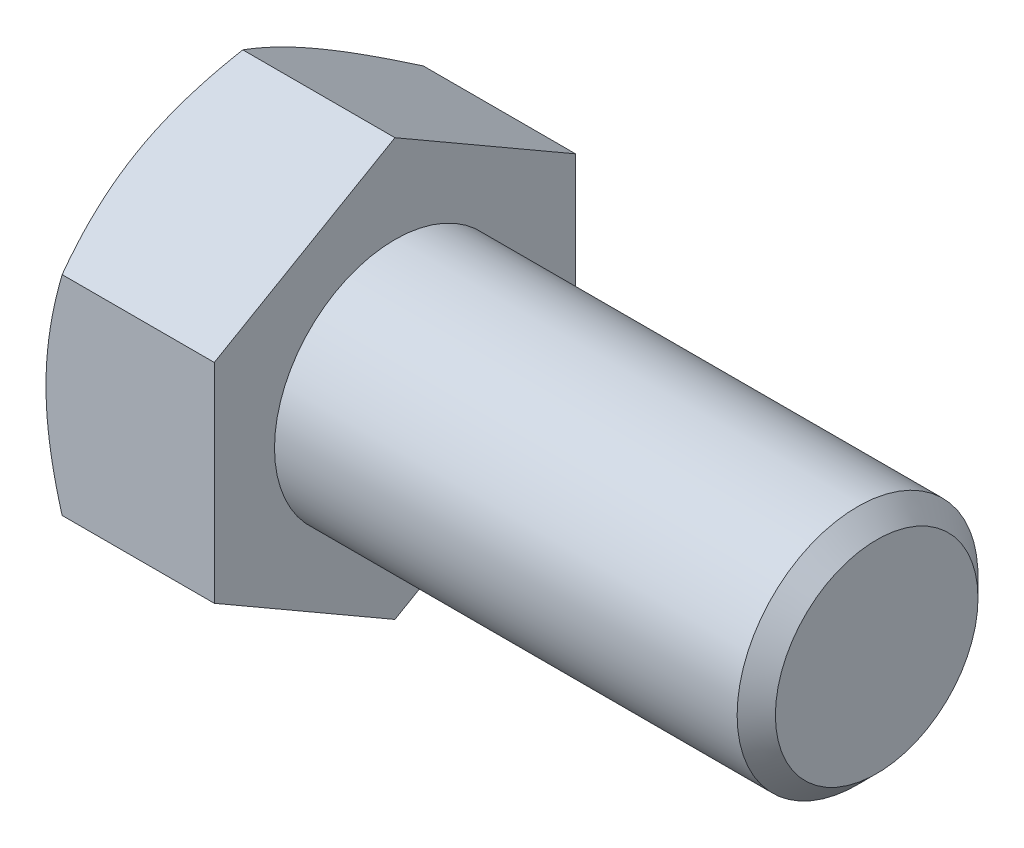
ISO-10303-21;
HEADER;
FILE_DESCRIPTION(('STEP AP214'),'2;1');
FILE_NAME('part.step','',(''),(''),'','','');
FILE_SCHEMA(('AUTOMOTIVE_DESIGN { 1 0 10303 214 1 1 1 1 }'));
ENDSEC;
DATA;
#1=APPLICATION_CONTEXT('core data for automotive mechanical design processes');
#2=APPLICATION_PROTOCOL_DEFINITION('international standard','automotive_design',2000,#1);
#3=PRODUCT_CONTEXT('',#1,'mechanical');
#4=PRODUCT('Part','Part','',(#3));
#5=PRODUCT_RELATED_PRODUCT_CATEGORY('part','',(#4));
#6=PRODUCT_DEFINITION_FORMATION('','',#4);
#7=PRODUCT_DEFINITION_CONTEXT('part definition',#1,'design');
#8=PRODUCT_DEFINITION('design','',#6,#7);
#9=PRODUCT_DEFINITION_SHAPE('','',#8);
#10=(LENGTH_UNIT() NAMED_UNIT(*) SI_UNIT(.MILLI.,.METRE.));
#11=(NAMED_UNIT(*) PLANE_ANGLE_UNIT() SI_UNIT($,.RADIAN.));
#12=(NAMED_UNIT(*) SI_UNIT($,.STERADIAN.) SOLID_ANGLE_UNIT());
#13=UNCERTAINTY_MEASURE_WITH_UNIT(LENGTH_MEASURE(1.E-05),#10,'distance_accuracy_value','');
#14=(GEOMETRIC_REPRESENTATION_CONTEXT(3) GLOBAL_UNCERTAINTY_ASSIGNED_CONTEXT((#13)) GLOBAL_UNIT_ASSIGNED_CONTEXT((#10,
#11,#12)) REPRESENTATION_CONTEXT('',''));
#15=CARTESIAN_POINT('',(0.,0.,0.));
#16=DIRECTION('',(0.,0.,1.));
#17=DIRECTION('',(1.,0.,0.));
#18=AXIS2_PLACEMENT_3D('',#15,#16,#17);
#19=CARTESIAN_POINT('',(13.3096,8.24889197104677,-14.2875));
#20=DIRECTION('',(0.,-0.866025403784438,0.5));
#21=DIRECTION('',(0.,-0.5,-0.866025403784438));
#22=AXIS2_PLACEMENT_3D('',#19,#20,#21);
#23=PLANE('',#22);
#24=CARTESIAN_POINT('',(1.27617469631979,16.4978994121474,0.000199999999999582));
#25=CARTESIAN_POINT('',(1.17150354049374,16.316591962665,-0.313833714294314));
#26=CARTESIAN_POINT('',(1.07158215537579,16.1345773166767,-0.629092328867607));
#27=CARTESIAN_POINT('',(0.882559201585307,15.7690884807822,-1.26213756223605));
#28=CARTESIAN_POINT('',(0.793461191524302,15.5856138318553,-1.5799249760784));
#29=CARTESIAN_POINT('',(0.627282646740068,15.2168504028066,-2.21864197116398));
#30=CARTESIAN_POINT('',(0.550230545696853,15.0315583957425,-2.53957714163546));
#31=CARTESIAN_POINT('',(0.409798352887989,14.6596868248225,-3.18367759635941));
#32=CARTESIAN_POINT('',(0.346417481149996,14.4731073350473,-3.50684275230036));
#33=CARTESIAN_POINT('',(0.236023554267069,14.1034416805247,-4.14712244774659));
#34=CARTESIAN_POINT('',(0.188645115273865,13.9203829601652,-4.46418945217786));
#35=CARTESIAN_POINT('',(0.109201912674412,13.5534267067704,-5.09977632721271));
#36=CARTESIAN_POINT('',(0.0771374438271073,13.3695291576584,-5.41829622566207));
#37=CARTESIAN_POINT('',(0.0291317909883738,13.0014251352584,-6.05587109492942));
#38=CARTESIAN_POINT('',(0.0131714475146444,12.8172192908535,-6.37492497648983));
#39=CARTESIAN_POINT('',(-0.00228271550063084,12.448637559964,-7.01332726113216));
#40=CARTESIAN_POINT('',(-0.00177704383827308,12.2642616789095,-7.33267565480881));
#41=CARTESIAN_POINT('',(0.0145506803037078,11.9195719861559,-7.92969571550333));
#42=CARTESIAN_POINT('',(0.0283811431962136,11.759233611051,-8.20740992758799));
#43=CARTESIAN_POINT('',(0.0682339694513755,11.4389256760858,-8.76219954501513));
#44=CARTESIAN_POINT('',(0.0942571951847597,11.2789561431174,-9.03927490377954));
#45=CARTESIAN_POINT('',(0.158041814881286,10.9594727825021,-9.59263631653807));
#46=CARTESIAN_POINT('',(0.195812903582829,10.7999594414437,-9.86892152773624));
#47=CARTESIAN_POINT('',(0.282430562472694,10.4816805882453,-10.4201966724507));
#48=CARTESIAN_POINT('',(0.331277885597339,10.3229151276936,-10.6951865166133));
#49=CARTESIAN_POINT('',(0.495669002146555,9.84097374681805,-11.5299334745597));
#50=CARTESIAN_POINT('',(0.627604309461495,9.51919345055701,-12.0872732965584));
#51=CARTESIAN_POINT('',(0.927043495545048,8.88043099732144,-13.1936423195297));
#52=CARTESIAN_POINT('',(1.09447704990011,8.56344066203608,-13.7426856857522));
#53=CARTESIAN_POINT('',(1.27617469631978,8.24877650099293,-14.2877));
#54=B_SPLINE_CURVE_WITH_KNOTS('',3,(#24,#25,#26,#27,#28,#29,#30,#31,#32,#33,#34,#35,#36,#37,#38,
#39,#40,#41,#42,#43,#44,#45,#46,#47,#48,#49,#50,#51,#52,#53),.UNSPECIFIED.,.F.,.F.,(4,2,2,2,2,2,
2,2,2,2,2,2,2,2,4),(0.,1.1322886698782,2.26494862244556,3.40024304981971,4.53547268912058,
5.64268215336774,6.74991292800918,7.85582484363027,8.96170258685889,9.92439507576008,
10.8871556643353,11.8507128733959,12.8143356024524,14.7839571212635,16.7497125507192),.UNSPECIFIED.);
#55=CARTESIAN_POINT('',(1.27610802895322,16.4977839420936,0.));
#56=VERTEX_POINT('',#55);
#57=CARTESIAN_POINT('',(0.,12.3733379565702,-7.14375));
#58=VERTEX_POINT('',#57);
#59=EDGE_CURVE('E33',#56,#58,#54,.T.);
#60=ORIENTED_EDGE('',*,*,#59,.F.);
#61=DIRECTION('',(-1.,0.,0.));
#62=VECTOR('',#61,1.);
#63=CARTESIAN_POINT('',(13.3096,16.4977839420936,0.));
#64=LINE('',#63,#62);
#65=CARTESIAN_POINT('',(13.3096,16.4977839420936,0.));
#66=VERTEX_POINT('',#65);
#67=EDGE_CURVE('E129',#66,#56,#64,.T.);
#68=ORIENTED_EDGE('',*,*,#67,.F.);
#69=DIRECTION('',(0.,0.5,0.866025403784438));
#70=VECTOR('',#69,1.);
#71=CARTESIAN_POINT('',(13.3096,8.24889197104677,-14.2875));
#72=LINE('',#71,#70);
#73=CARTESIAN_POINT('',(13.3096,8.24889197104677,-14.2875));
#74=VERTEX_POINT('',#73);
#75=EDGE_CURVE('E214',#74,#66,#72,.T.);
#76=ORIENTED_EDGE('',*,*,#75,.F.);
#77=DIRECTION('',(-1.,0.,0.));
#78=VECTOR('',#77,1.);
#79=CARTESIAN_POINT('',(13.3096,8.24889197104677,-14.2875));
#80=LINE('',#79,#78);
#81=CARTESIAN_POINT('',(1.27610802895321,8.24889197104677,-14.2875));
#82=VERTEX_POINT('',#81);
#83=EDGE_CURVE('E117',#74,#82,#80,.T.);
#84=ORIENTED_EDGE('',*,*,#83,.T.);
#85=EDGE_CURVE('E111',#58,#82,#54,.T.);
#86=ORIENTED_EDGE('',*,*,#85,.F.);
#87=EDGE_LOOP('',(#60,#68,#76,#84,#86));
#88=FACE_BOUND('',#87,.T.);
#89=ADVANCED_FACE('F17',(#88),#23,.F.);
#90=CARTESIAN_POINT('',(13.3096,16.4977839420936,0.));
#91=DIRECTION('',(0.,-0.866025403784438,-0.5));
#92=DIRECTION('',(0.,0.5,-0.866025403784438));
#93=AXIS2_PLACEMENT_3D('',#90,#91,#92);
#94=PLANE('',#93);
#95=CARTESIAN_POINT('',(1.27617469631978,8.24877650099293,14.2877));
#96=CARTESIAN_POINT('',(1.17150354049373,8.43008395047537,13.9736662857057));
#97=CARTESIAN_POINT('',(1.07158215537578,8.61209859646361,13.6584076711324));
#98=CARTESIAN_POINT('',(0.882559201585304,8.97758743235809,13.0253624377639));
#99=CARTESIAN_POINT('',(0.793461191524299,9.16106208128505,12.7075750239216));
#100=CARTESIAN_POINT('',(0.627282646740065,9.5298255103337,12.068858028836));
#101=CARTESIAN_POINT('',(0.55023054569685,9.71511751739782,11.7479228583645));
#102=CARTESIAN_POINT('',(0.409798352887985,10.0869890883179,11.1038224036406));
#103=CARTESIAN_POINT('',(0.346417481149992,10.2735685780931,10.7806572476996));
#104=CARTESIAN_POINT('',(0.236023554267066,10.6432342326156,10.1403775522534));
#105=CARTESIAN_POINT('',(0.188645115273862,10.8262929529751,9.82331054782214));
#106=CARTESIAN_POINT('',(0.10920191267441,11.1932492063699,9.18772367278729));
#107=CARTESIAN_POINT('',(0.0771374438271041,11.3771467554819,8.86920377433793));
#108=CARTESIAN_POINT('',(0.02913179098837,11.7452507778819,8.23162890507058));
#109=CARTESIAN_POINT('',(0.0131714475146414,11.9294566222868,7.91257502351017));
#110=CARTESIAN_POINT('',(-0.00228271550063179,12.2980383531764,7.27417273886784));
#111=CARTESIAN_POINT('',(-0.00177704383827272,12.4824142342309,6.9548243451912));
#112=CARTESIAN_POINT('',(0.0145506803037076,12.8271039269845,6.35780428449668));
#113=CARTESIAN_POINT('',(0.0283811431962119,12.9874423020893,6.08009007241201));
#114=CARTESIAN_POINT('',(0.0682339694513732,13.3077502370545,5.52530045498486));
#115=CARTESIAN_POINT('',(0.0942571951847582,13.4677197700229,5.24822509622045));
#116=CARTESIAN_POINT('',(0.158041814881286,13.7872031306382,4.69486368346192));
#117=CARTESIAN_POINT('',(0.195812903582829,13.9467164716966,4.41857847226376));
#118=CARTESIAN_POINT('',(0.282430562472695,14.264995324895,3.86730332754926));
#119=CARTESIAN_POINT('',(0.331277885597339,14.4237607854467,3.59231348338674));
#120=CARTESIAN_POINT('',(0.495669002146554,14.9057021663223,2.75756652544034));
#121=CARTESIAN_POINT('',(0.627604309461494,15.2274824625833,2.20022670344164));
#122=CARTESIAN_POINT('',(0.927043495545049,15.8662449158189,1.09385768047029));
#123=CARTESIAN_POINT('',(1.09447704990012,16.1832352511043,0.544814314247755));
#124=CARTESIAN_POINT('',(1.27617469631979,16.4978994121474,-0.000200000000001206));
#125=B_SPLINE_CURVE_WITH_KNOTS('',3,(#95,#96,#97,#98,#99,#100,#101,#102,#103,#104,#105,#106,
#107,#108,#109,#110,#111,#112,#113,#114,#115,#116,#117,#118,#119,#120,#121,#122,#123,#124),
.UNSPECIFIED.,.F.,.F.,(4,2,2,2,2,2,2,2,2,2,2,2,2,2,4),(0.,1.1322886698782,2.26494862244556,
3.4002430498197,4.53547268912058,5.64268215336774,6.74991292800917,7.85582484363026,
8.96170258685889,9.92439507576008,10.8871556643353,11.8507128733959,12.8143356024524,
14.7839571212635,16.7497125507192),.UNSPECIFIED.);
#126=CARTESIAN_POINT('',(1.27610802895321,8.24889197104677,14.2875));
#127=VERTEX_POINT('',#126);
#128=CARTESIAN_POINT('',(0.,12.3733379565702,7.14375));
#129=VERTEX_POINT('',#128);
#130=EDGE_CURVE('E40',#127,#129,#125,.T.);
#131=ORIENTED_EDGE('',*,*,#130,.F.);
#132=DIRECTION('',(-1.,0.,0.));
#133=VECTOR('',#132,1.);
#134=CARTESIAN_POINT('',(13.3096,8.24889197104677,14.2875));
#135=LINE('',#134,#133);
#136=CARTESIAN_POINT('',(13.3096,8.24889197104677,14.2875));
#137=VERTEX_POINT('',#136);
#138=EDGE_CURVE('E127',#137,#127,#135,.T.);
#139=ORIENTED_EDGE('',*,*,#138,.F.);
#140=DIRECTION('',(0.,-0.5,0.866025403784438));
#141=VECTOR('',#140,1.);
#142=CARTESIAN_POINT('',(13.3096,16.4977839420936,0.));
#143=LINE('',#142,#141);
#144=EDGE_CURVE('E212',#66,#137,#143,.T.);
#145=ORIENTED_EDGE('',*,*,#144,.F.);
#146=ORIENTED_EDGE('',*,*,#67,.T.);
#147=EDGE_CURVE('E144',#129,#56,#125,.T.);
#148=ORIENTED_EDGE('',*,*,#147,.F.);
#149=EDGE_LOOP('',(#131,#139,#145,#146,#148));
#150=FACE_BOUND('',#149,.T.);
#151=ADVANCED_FACE('F150',(#150),#94,.F.);
#152=CARTESIAN_POINT('',(13.3096,8.24889197104677,14.2875));
#153=DIRECTION('',(0.,0.,-1.));
#154=DIRECTION('',(0.,1.,0.));
#155=AXIS2_PLACEMENT_3D('',#152,#153,#154);
#156=PLANE('',#155);
#157=CARTESIAN_POINT('',(7.08559653091287,-22.3898851403977,14.2875));
#158=CARTESIAN_POINT('',(6.93326774728018,-22.0768961485065,14.2875));
#159=CARTESIAN_POINT('',(6.78168115524728,-21.7635461076253,14.2875));
#160=CARTESIAN_POINT('',(6.48015999479454,-21.1360486675519,14.2875));
#161=CARTESIAN_POINT('',(6.3302254422901,-20.8219012607137,14.2875));
#162=CARTESIAN_POINT('',(5.88311326936994,-19.8780695997121,14.2875));
#163=CARTESIAN_POINT('',(5.58867059111872,-19.247084957934,14.2875));
#164=CARTESIAN_POINT('',(5.00727922083418,-17.9776461473273,14.2875));
#165=CARTESIAN_POINT('',(4.72037808476414,-17.3391701473184,14.2875));
#166=CARTESIAN_POINT('',(4.15800525940538,-16.0572214756457,14.2875));
#167=CARTESIAN_POINT('',(3.88253304540861,-15.4137490349849,14.2875));
#168=CARTESIAN_POINT('',(3.3370396675848,-14.0991063623123,14.2875));
#169=CARTESIAN_POINT('',(3.06751087102779,-13.427730783812,14.2875));
#170=CARTESIAN_POINT('',(2.54829414701892,-12.0772064856565,14.2875));
#171=CARTESIAN_POINT('',(2.29860841369515,-11.3980569158718,14.2875));
#172=CARTESIAN_POINT('',(1.82546713347176,-10.0321237241472,14.2875));
#173=CARTESIAN_POINT('',(1.60196042520998,-9.34535796384217,14.2875));
#174=CARTESIAN_POINT('',(1.18818152853814,-7.96191308991347,14.2875));
#175=CARTESIAN_POINT('',(0.997899114310368,-7.26523709812134,14.2875));
#176=CARTESIAN_POINT('',(0.744688974538726,-6.21459800125072,14.2875));
#177=CARTESIAN_POINT('',(0.665833592890657,-5.86445181168125,14.2875));
#178=CARTESIAN_POINT('',(0.519775761529073,-5.16172478937007,14.2875));
#179=CARTESIAN_POINT('',(0.452573084094944,-4.809144004346,14.2875));
#180=CARTESIAN_POINT('',(0.330991997803059,-4.1017733146598,14.2875));
#181=CARTESIAN_POINT('',(0.276613366867474,-3.74698344836222,14.2875));
#182=CARTESIAN_POINT('',(0.181756259237052,-3.03555342863086,14.2875));
#183=CARTESIAN_POINT('',(0.141277163865972,-2.67891335826818,14.2875));
#184=CARTESIAN_POINT('',(0.075543650045434,-1.96903610663562,14.2875));
#185=CARTESIAN_POINT('',(0.0500928077740681,-1.61581722652355,14.2875));
#186=CARTESIAN_POINT('',(0.0141622343996009,-0.908619532356783,14.2875));
#187=CARTESIAN_POINT('',(0.00368224833251761,-0.554640731346896,14.2875));
#188=CARTESIAN_POINT('',(-0.00205625515740654,0.153442979231244,14.2875));
#189=CARTESIAN_POINT('',(0.00268522427340234,0.507547888773415,14.2875));
#190=CARTESIAN_POINT('',(0.027271291764438,1.21523734452437,14.2875));
#191=CARTESIAN_POINT('',(0.0471165519034985,1.56882186687577,14.2875));
#192=CARTESIAN_POINT('',(0.111996031071708,2.4116583797756,14.2875));
#193=CARTESIAN_POINT('',(0.163810406450368,2.90039811194561,14.2875));
#194=CARTESIAN_POINT('',(0.293528569466128,3.87440480488909,14.2875));
#195=CARTESIAN_POINT('',(0.371435712647262,4.35967131080164,14.2875));
#196=CARTESIAN_POINT('',(0.550568352001118,5.32621625313482,14.2875));
#197=CARTESIAN_POINT('',(0.651811306760672,5.80749142276727,14.2875));
#198=CARTESIAN_POINT('',(0.874513374276012,6.76529068673456,14.2875));
#199=CARTESIAN_POINT('',(0.995972236678832,7.24181483982835,14.2875));
#200=CARTESIAN_POINT('',(1.25905167417799,8.20075205778827,14.2875));
#201=CARTESIAN_POINT('',(1.40106388456011,8.68305692684689,14.2875));
#202=CARTESIAN_POINT('',(1.70023403432786,9.64291929226151,14.2875));
#203=CARTESIAN_POINT('',(1.85739207777889,10.1204767559737,14.2875));
#204=CARTESIAN_POINT('',(2.18431745757463,11.0710723127659,14.2875));
#205=CARTESIAN_POINT('',(2.35408093456882,11.544111739462,14.2875));
#206=CARTESIAN_POINT('',(2.70417375232529,12.4862394675865,14.2875));
#207=CARTESIAN_POINT('',(2.88450294276728,12.9553278251189,14.2875));
#208=CARTESIAN_POINT('',(3.33642274249973,14.0985450123052,14.2875));
#209=CARTESIAN_POINT('',(3.61283070485534,14.770767095611,14.2875));
#210=CARTESIAN_POINT('',(4.17998789378479,16.1091534086177,14.2875));
#211=CARTESIAN_POINT('',(4.470738180305,16.7753171862673,14.2875));
#212=CARTESIAN_POINT('',(5.06358550000991,18.1027741716843,14.2875));
#213=CARTESIAN_POINT('',(5.36568552575697,18.7640660391256,14.2875));
#214=CARTESIAN_POINT('',(5.97884038094197,20.0824528287766,14.2875));
#215=CARTESIAN_POINT('',(6.28989497805701,20.7395478593321,14.2875));
#216=CARTESIAN_POINT('',(6.91960732570601,22.0510812939211,14.2875));
#217=CARTESIAN_POINT('',(7.23827402908063,22.7055153913756,14.2875));
#218=CARTESIAN_POINT('',(7.88149356008952,24.0114843998786,14.2875));
#219=CARTESIAN_POINT('',(8.2060464185312,24.6630192957309,14.2875));
#220=CARTESIAN_POINT('',(8.85994319829522,25.9635553617576,14.2875));
#221=CARTESIAN_POINT('',(9.1892863940345,26.6125568971502,14.2875));
#222=CARTESIAN_POINT('',(9.85199752739623,27.9084978324255,14.2875));
#223=CARTESIAN_POINT('',(10.1853654561409,28.555437236853,14.2875));
#224=CARTESIAN_POINT('',(11.1306522678145,30.3782153849138,14.2875));
#225=CARTESIAN_POINT('',(11.7464658067758,31.5520342270543,14.2875));
#226=CARTESIAN_POINT('',(12.9863637492688,33.8953480220263,14.2875));
#227=CARTESIAN_POINT('',(13.6104484992591,35.0648427910931,14.2875));
#228=CARTESIAN_POINT('',(14.8631697843525,37.3972192211191,14.2875));
#229=CARTESIAN_POINT('',(15.4917889329957,38.5601102267932,14.2875));
#230=CARTESIAN_POINT('',(16.4383496296699,40.3024250307733,14.2875));
#231=CARTESIAN_POINT('',(16.7544655515047,40.8828421143772,14.2875));
#232=CARTESIAN_POINT('',(17.3877853934411,42.0430813057571,14.2875));
#233=CARTESIAN_POINT('',(17.7049893118937,42.6229034144332,14.2875));
#234=CARTESIAN_POINT('',(18.0226732632783,43.2024624684083,14.2875));
#235=B_SPLINE_CURVE_WITH_KNOTS('',3,(#157,#158,#159,#160,#161,#162,#163,#164,#165,#166,#167,
#168,#169,#170,#171,#172,#173,#174,#175,#176,#177,#178,#179,#180,#181,#182,#183,#184,#185,#186,
#187,#188,#189,#190,#191,#192,#193,#194,#195,#196,#197,#198,#199,#200,#201,#202,#203,#204,#205,
#206,#207,#208,#209,#210,#211,#212,#213,#214,#215,#216,#217,#218,#219,#220,#221,#222,#223,#224,
#225,#226,#227,#228,#229,#230,#231,#232,#233,#234),.UNSPECIFIED.,.F.,.F.,(4,2,2,2,2,2,2,2,2,2,2,
2,2,2,2,2,2,2,2,2,2,2,2,2,2,2,2,2,2,2,2,2,2,2,2,2,2,2,4),(0.,1.04426611026885,2.08854227199574,
4.17739185153995,6.27722701936104,8.37696567568249,10.5470989949833,12.7174719418313,
14.8835299683505,17.048920142941,18.1255049291752,19.2020686740974,20.2786137744759,
21.3551109510055,22.4172073060168,23.4792855725806,24.5413636196078,25.6034889291002,
27.0771146749695,28.5509300027185,30.0258515587195,31.5007548507115,33.0087918261306,
34.5168391638508,36.024426678107,37.5319927488532,39.7122554194619,41.8926794609792,
44.0736825017389,46.2546290081198,48.4382809122898,50.6219442487211,52.8052802048644,
54.9886113458609,58.9652044042268,62.9419645611425,66.9077143187839,68.8904689713398,
70.8732206202619),.UNSPECIFIED.);
#236=CARTESIAN_POINT('',(1.27610802895322,-8.2488919710468,14.2875));
#237=VERTEX_POINT('',#236);
#238=CARTESIAN_POINT('',(0.,0.,14.2875));
#239=VERTEX_POINT('',#238);
#240=EDGE_CURVE('E224',#237,#239,#235,.T.);
#241=ORIENTED_EDGE('',*,*,#240,.F.);
#242=DIRECTION('',(-1.,0.,0.));
#243=VECTOR('',#242,1.);
#244=CARTESIAN_POINT('',(13.3096,-8.2488919710468,14.2875));
#245=LINE('',#244,#243);
#246=CARTESIAN_POINT('',(13.3096,-8.2488919710468,14.2875));
#247=VERTEX_POINT('',#246);
#248=EDGE_CURVE('E119',#247,#237,#245,.T.);
#249=ORIENTED_EDGE('',*,*,#248,.F.);
#250=DIRECTION('',(0.,-1.,0.));
#251=VECTOR('',#250,1.);
#252=CARTESIAN_POINT('',(13.3096,8.24889197104677,14.2875));
#253=LINE('',#252,#251);
#254=EDGE_CURVE('E208',#137,#247,#253,.T.);
#255=ORIENTED_EDGE('',*,*,#254,.F.);
#256=ORIENTED_EDGE('',*,*,#138,.T.);
#257=EDGE_CURVE('E166',#239,#127,#235,.T.);
#258=ORIENTED_EDGE('',*,*,#257,.F.);
#259=EDGE_LOOP('',(#241,#249,#255,#256,#258));
#260=FACE_BOUND('',#259,.T.);
#261=ADVANCED_FACE('F230',(#260),#156,.F.);
#262=CARTESIAN_POINT('',(13.3096,-16.4977839420936,0.));
#263=DIRECTION('',(0.,0.866025403784438,-0.5));
#264=DIRECTION('',(0.,0.5,0.866025403784438));
#265=AXIS2_PLACEMENT_3D('',#262,#263,#264);
#266=PLANE('',#265);
#267=CARTESIAN_POINT('',(1.27617469631981,-16.4978994121474,-0.000200000000000083));
#268=CARTESIAN_POINT('',(1.17150354049376,-16.316591962665,0.313833714294316));
#269=CARTESIAN_POINT('',(1.07158215537581,-16.1345773166768,0.629092328867609));
#270=CARTESIAN_POINT('',(0.882559201585333,-15.7690884807823,1.26213756223605));
#271=CARTESIAN_POINT('',(0.793461191524326,-15.5856138318553,1.5799249760784));
#272=CARTESIAN_POINT('',(0.627282646740092,-15.2168504028067,2.21864197116398));
#273=CARTESIAN_POINT('',(0.550230545696877,-15.0315583957425,2.53957714163546));
#274=CARTESIAN_POINT('',(0.409798352888013,-14.6596868248225,3.18367759635942));
#275=CARTESIAN_POINT('',(0.346417481150019,-14.4731073350473,3.50684275230037));
#276=CARTESIAN_POINT('',(0.236023554267092,-14.1034416805248,4.1471224477466));
#277=CARTESIAN_POINT('',(0.188645115273888,-13.9203829601652,4.46418945217787));
#278=CARTESIAN_POINT('',(0.109201912674435,-13.5534267067705,5.09977632721272));
#279=CARTESIAN_POINT('',(0.0771374438271293,-13.3695291576585,5.41829622566208));
#280=CARTESIAN_POINT('',(0.0291317909883963,-13.0014251352584,6.05587109492943));
#281=CARTESIAN_POINT('',(0.0131714475146685,-12.8172192908535,6.37492497648984));
#282=CARTESIAN_POINT('',(-0.00228271550061085,-12.448637559964,7.01332726113217));
#283=CARTESIAN_POINT('',(-0.00177704383825873,-12.2642616789095,7.33267565480882));
#284=CARTESIAN_POINT('',(0.014550680303723,-11.9195719861559,7.92969571550334));
#285=CARTESIAN_POINT('',(0.0283811431962337,-11.759233611051,8.20740992758801));
#286=CARTESIAN_POINT('',(0.0682339694513993,-11.4389256760859,8.76219954501515));
#287=CARTESIAN_POINT('',(0.0942571951847822,-11.2789561431174,9.03927490377956));
#288=CARTESIAN_POINT('',(0.158041814881308,-10.9594727825022,9.59263631653809));
#289=CARTESIAN_POINT('',(0.19581290358285,-10.7999594414438,9.86892152773625));
#290=CARTESIAN_POINT('',(0.282430562472715,-10.4816805882453,10.4201966724507));
#291=CARTESIAN_POINT('',(0.33127788559736,-10.3229151276937,10.6951865166133));
#292=CARTESIAN_POINT('',(0.495669002146575,-9.8409737468181,11.5299334745597));
#293=CARTESIAN_POINT('',(0.627604309461514,-9.51919345055705,12.0872732965584));
#294=CARTESIAN_POINT('',(0.927043495545062,-8.88043099732148,13.1936423195297));
#295=CARTESIAN_POINT('',(1.09447704990012,-8.56344066203611,13.7426856857522));
#296=CARTESIAN_POINT('',(1.27617469631979,-8.24877650099296,14.2877));
#297=B_SPLINE_CURVE_WITH_KNOTS('',3,(#267,#268,#269,#270,#271,#272,#273,#274,#275,#276,#277,
#278,#279,#280,#281,#282,#283,#284,#285,#286,#287,#288,#289,#290,#291,#292,#293,#294,#295,#296),
.UNSPECIFIED.,.F.,.F.,(4,2,2,2,2,2,2,2,2,2,2,2,2,2,4),(0.,1.13228866987821,2.26494862244556,
3.40024304981971,4.53547268912059,5.64268215336776,6.74991292800919,7.85582484363028,
8.96170258685892,9.9243950757601,10.8871556643353,11.850712873396,12.8143356024524,
14.7839571212635,16.7497125507192),.UNSPECIFIED.);
#298=CARTESIAN_POINT('',(1.27610802895323,-16.4977839420936,0.));
#299=VERTEX_POINT('',#298);
#300=CARTESIAN_POINT('',(0.,-12.3733379565702,7.14375));
#301=VERTEX_POINT('',#300);
#302=EDGE_CURVE('E152',#299,#301,#297,.T.);
#303=ORIENTED_EDGE('',*,*,#302,.F.);
#304=DIRECTION('',(-1.,0.,0.));
#305=VECTOR('',#304,1.);
#306=CARTESIAN_POINT('',(13.3096,-16.4977839420936,0.));
#307=LINE('',#306,#305);
#308=CARTESIAN_POINT('',(13.3096,-16.4977839420936,0.));
#309=VERTEX_POINT('',#308);
#310=EDGE_CURVE('E116',#309,#299,#307,.T.);
#311=ORIENTED_EDGE('',*,*,#310,.F.);
#312=DIRECTION('',(0.,-0.5,-0.866025403784438));
#313=VECTOR('',#312,1.);
#314=CARTESIAN_POINT('',(13.3096,-16.4977839420936,0.));
#315=LINE('',#314,#313);
#316=EDGE_CURVE('E206',#247,#309,#315,.T.);
#317=ORIENTED_EDGE('',*,*,#316,.F.);
#318=ORIENTED_EDGE('',*,*,#248,.T.);
#319=EDGE_CURVE('E154',#301,#237,#297,.T.);
#320=ORIENTED_EDGE('',*,*,#319,.F.);
#321=EDGE_LOOP('',(#303,#311,#317,#318,#320));
#322=FACE_BOUND('',#321,.T.);
#323=ADVANCED_FACE('F202',(#322),#266,.F.);
#324=CARTESIAN_POINT('',(13.3096,-8.2488919710468,-14.2875));
#325=DIRECTION('',(0.,0.866025403784438,0.5));
#326=DIRECTION('',(0.,-0.5,0.866025403784438));
#327=AXIS2_PLACEMENT_3D('',#324,#325,#326);
#328=PLANE('',#327);
#329=CARTESIAN_POINT('',(1.27617469631979,-8.24877650099296,-14.2877));
#330=CARTESIAN_POINT('',(1.17150354049374,-8.4300839504754,-13.9736662857057));
#331=CARTESIAN_POINT('',(1.07158215537579,-8.61209859646364,-13.6584076711324));
#332=CARTESIAN_POINT('',(0.882559201585316,-8.97758743235812,-13.0253624377639));
#333=CARTESIAN_POINT('',(0.793461191524311,-9.16106208128508,-12.7075750239216));
#334=CARTESIAN_POINT('',(0.627282646740076,-9.52982551033373,-12.068858028836));
#335=CARTESIAN_POINT('',(0.550230545696861,-9.71511751739785,-11.7479228583645));
#336=CARTESIAN_POINT('',(0.409798352887998,-10.0869890883179,-11.1038224036406));
#337=CARTESIAN_POINT('',(0.346417481150005,-10.2735685780931,-10.7806572476996));
#338=CARTESIAN_POINT('',(0.23602355426708,-10.6432342326156,-10.1403775522534));
#339=CARTESIAN_POINT('',(0.188645115273877,-10.8262929529752,-9.82331054782214));
#340=CARTESIAN_POINT('',(0.109201912674424,-11.1932492063699,-9.18772367278729));
#341=CARTESIAN_POINT('',(0.0771374438271196,-11.3771467554819,-8.86920377433793));
#342=CARTESIAN_POINT('',(0.0291317909883865,-11.745250777882,-8.23162890507058));
#343=CARTESIAN_POINT('',(0.0131714475146582,-11.9294566222869,-7.91257502351017));
#344=CARTESIAN_POINT('',(-0.00228271550061607,-12.2980383531764,-7.27417273886784));
#345=CARTESIAN_POINT('',(-0.00177704383825828,-12.4824142342309,-6.95482434519119));
#346=CARTESIAN_POINT('',(0.0145506803037235,-12.8271039269845,-6.35780428449667));
#347=CARTESIAN_POINT('',(0.0283811431962301,-12.9874423020893,-6.080090072412));
#348=CARTESIAN_POINT('',(0.068233969451393,-13.3077502370545,-5.52530045498486));
#349=CARTESIAN_POINT('',(0.0942571951847773,-13.467719770023,-5.24822509622045));
#350=CARTESIAN_POINT('',(0.158041814881304,-13.7872031306382,-4.69486368346192));
#351=CARTESIAN_POINT('',(0.195812903582848,-13.9467164716966,-4.41857847226375));
#352=CARTESIAN_POINT('',(0.282430562472714,-14.2649953248951,-3.86730332754925));
#353=CARTESIAN_POINT('',(0.331277885597359,-14.4237607854467,-3.59231348338673));
#354=CARTESIAN_POINT('',(0.495669002146576,-14.9057021663223,-2.75756652544034));
#355=CARTESIAN_POINT('',(0.627604309461516,-15.2274824625834,-2.20022670344163));
#356=CARTESIAN_POINT('',(0.92704349554507,-15.8662449158189,-1.09385768047029));
#357=CARTESIAN_POINT('',(1.09447704990014,-16.1832352511043,-0.54481431424775));
#358=CARTESIAN_POINT('',(1.27617469631981,-16.4978994121474,0.00020000000000077));
#359=B_SPLINE_CURVE_WITH_KNOTS('',3,(#329,#330,#331,#332,#333,#334,#335,#336,#337,#338,#339,
#340,#341,#342,#343,#344,#345,#346,#347,#348,#349,#350,#351,#352,#353,#354,#355,#356,#357,#358),
.UNSPECIFIED.,.F.,.F.,(4,2,2,2,2,2,2,2,2,2,2,2,2,2,4),(0.,1.1322886698782,2.26494862244556,
3.4002430498197,4.53547268912058,5.64268215336774,6.74991292800917,7.85582484363026,
8.96170258685889,9.92439507576008,10.8871556643353,11.8507128733959,12.8143356024524,
14.7839571212635,16.7497125507192),.UNSPECIFIED.);
#360=CARTESIAN_POINT('',(1.27610802895322,-8.2488919710468,-14.2875));
#361=VERTEX_POINT('',#360);
#362=CARTESIAN_POINT('',(0.,-12.3733379565702,-7.14375));
#363=VERTEX_POINT('',#362);
#364=EDGE_CURVE('E93',#361,#363,#359,.T.);
#365=ORIENTED_EDGE('',*,*,#364,.F.);
#366=DIRECTION('',(-1.,0.,0.));
#367=VECTOR('',#366,1.);
#368=CARTESIAN_POINT('',(13.3096,-8.2488919710468,-14.2875));
#369=LINE('',#368,#367);
#370=CARTESIAN_POINT('',(13.3096,-8.2488919710468,-14.2875));
#371=VERTEX_POINT('',#370);
#372=EDGE_CURVE('E107',#371,#361,#369,.T.);
#373=ORIENTED_EDGE('',*,*,#372,.F.);
#374=DIRECTION('',(0.,0.5,-0.866025403784438));
#375=VECTOR('',#374,1.);
#376=CARTESIAN_POINT('',(13.3096,-8.2488919710468,-14.2875));
#377=LINE('',#376,#375);
#378=EDGE_CURVE('E204',#309,#371,#377,.T.);
#379=ORIENTED_EDGE('',*,*,#378,.F.);
#380=ORIENTED_EDGE('',*,*,#310,.T.);
#381=EDGE_CURVE('E110',#363,#299,#359,.T.);
#382=ORIENTED_EDGE('',*,*,#381,.F.);
#383=EDGE_LOOP('',(#365,#373,#379,#380,#382));
#384=FACE_BOUND('',#383,.T.);
#385=ADVANCED_FACE('F105',(#384),#328,.F.);
#386=CARTESIAN_POINT('',(13.3096,8.24889197104677,-14.2875));
#387=DIRECTION('',(0.,0.,1.));
#388=DIRECTION('',(0.,-1.,0.));
#389=AXIS2_PLACEMENT_3D('',#386,#387,#388);
#390=PLANE('',#389);
#391=CARTESIAN_POINT('',(7.08559653091287,-22.3898851403977,-14.2875));
#392=CARTESIAN_POINT('',(6.93326774728018,-22.0768961485065,-14.2875));
#393=CARTESIAN_POINT('',(6.78168115524728,-21.7635461076253,-14.2875));
#394=CARTESIAN_POINT('',(6.48015999479454,-21.1360486675519,-14.2875));
#395=CARTESIAN_POINT('',(6.3302254422901,-20.8219012607137,-14.2875));
#396=CARTESIAN_POINT('',(5.88311326936994,-19.8780695997121,-14.2875));
#397=CARTESIAN_POINT('',(5.58867059111872,-19.247084957934,-14.2875));
#398=CARTESIAN_POINT('',(5.00727922083418,-17.9776461473273,-14.2875));
#399=CARTESIAN_POINT('',(4.72037808476414,-17.3391701473184,-14.2875));
#400=CARTESIAN_POINT('',(4.15800525940538,-16.0572214756457,-14.2875));
#401=CARTESIAN_POINT('',(3.88253304540861,-15.4137490349849,-14.2875));
#402=CARTESIAN_POINT('',(3.3370396675848,-14.0991063623123,-14.2875));
#403=CARTESIAN_POINT('',(3.06751087102779,-13.427730783812,-14.2875));
#404=CARTESIAN_POINT('',(2.54829414701892,-12.0772064856565,-14.2875));
#405=CARTESIAN_POINT('',(2.29860841369515,-11.3980569158718,-14.2875));
#406=CARTESIAN_POINT('',(1.82546713347176,-10.0321237241472,-14.2875));
#407=CARTESIAN_POINT('',(1.60196042520998,-9.34535796384217,-14.2875));
#408=CARTESIAN_POINT('',(1.18818152853814,-7.96191308991347,-14.2875));
#409=CARTESIAN_POINT('',(0.997899114310368,-7.26523709812134,-14.2875));
#410=CARTESIAN_POINT('',(0.744688974538726,-6.21459800125072,-14.2875));
#411=CARTESIAN_POINT('',(0.665833592890657,-5.86445181168125,-14.2875));
#412=CARTESIAN_POINT('',(0.519775761529072,-5.16172478937007,-14.2875));
#413=CARTESIAN_POINT('',(0.452573084094943,-4.809144004346,-14.2875));
#414=CARTESIAN_POINT('',(0.330991997803058,-4.1017733146598,-14.2875));
#415=CARTESIAN_POINT('',(0.276613366867473,-3.74698344836222,-14.2875));
#416=CARTESIAN_POINT('',(0.181756259237051,-3.03555342863086,-14.2875));
#417=CARTESIAN_POINT('',(0.141277163865971,-2.67891335826818,-14.2875));
#418=CARTESIAN_POINT('',(0.0755436500454333,-1.96903610663562,-14.2875));
#419=CARTESIAN_POINT('',(0.0500928077740675,-1.61581722652355,-14.2875));
#420=CARTESIAN_POINT('',(0.0141622343996004,-0.908619532356782,-14.2875));
#421=CARTESIAN_POINT('',(0.00368224833251713,-0.554640731346894,-14.2875));
#422=CARTESIAN_POINT('',(-0.00205625515740708,0.153442979231244,-14.2875));
#423=CARTESIAN_POINT('',(0.00268522427340166,0.507547888773414,-14.2875));
#424=CARTESIAN_POINT('',(0.0272712917644379,1.21523734452436,-14.2875));
#425=CARTESIAN_POINT('',(0.0471165519034991,1.56882186687576,-14.2875));
#426=CARTESIAN_POINT('',(0.111996031071708,2.4116583797756,-14.2875));
#427=CARTESIAN_POINT('',(0.163810406450367,2.90039811194561,-14.2875));
#428=CARTESIAN_POINT('',(0.293528569466126,3.87440480488909,-14.2875));
#429=CARTESIAN_POINT('',(0.371435712647261,4.35967131080164,-14.2875));
#430=CARTESIAN_POINT('',(0.550568352001119,5.32621625313482,-14.2875));
#431=CARTESIAN_POINT('',(0.651811306760672,5.80749142276727,-14.2875));
#432=CARTESIAN_POINT('',(0.874513374276013,6.76529068673457,-14.2875));
#433=CARTESIAN_POINT('',(0.995972236678834,7.24181483982836,-14.2875));
#434=CARTESIAN_POINT('',(1.25905167417799,8.20075205778828,-14.2875));
#435=CARTESIAN_POINT('',(1.40106388456012,8.6830569268469,-14.2875));
#436=CARTESIAN_POINT('',(1.70023403432786,9.64291929226152,-14.2875));
#437=CARTESIAN_POINT('',(1.8573920777789,10.1204767559737,-14.2875));
#438=CARTESIAN_POINT('',(2.18431745757464,11.071072312766,-14.2875));
#439=CARTESIAN_POINT('',(2.35408093456883,11.544111739462,-14.2875));
#440=CARTESIAN_POINT('',(2.70417375232529,12.4862394675865,-14.2875));
#441=CARTESIAN_POINT('',(2.88450294276728,12.9553278251189,-14.2875));
#442=CARTESIAN_POINT('',(3.33642274249973,14.0985450123052,-14.2875));
#443=CARTESIAN_POINT('',(3.61283070485534,14.770767095611,-14.2875));
#444=CARTESIAN_POINT('',(4.1799878937848,16.1091534086177,-14.2875));
#445=CARTESIAN_POINT('',(4.470738180305,16.7753171862674,-14.2875));
#446=CARTESIAN_POINT('',(5.06358550000992,18.1027741716843,-14.2875));
#447=CARTESIAN_POINT('',(5.36568552575698,18.7640660391256,-14.2875));
#448=CARTESIAN_POINT('',(5.97884038094198,20.0824528287766,-14.2875));
#449=CARTESIAN_POINT('',(6.28989497805702,20.7395478593321,-14.2875));
#450=CARTESIAN_POINT('',(6.91960732570602,22.0510812939211,-14.2875));
#451=CARTESIAN_POINT('',(7.23827402908064,22.7055153913756,-14.2875));
#452=CARTESIAN_POINT('',(7.88149356008953,24.0114843998787,-14.2875));
#453=CARTESIAN_POINT('',(8.20604641853121,24.6630192957309,-14.2875));
#454=CARTESIAN_POINT('',(8.85994319829523,25.9635553617577,-14.2875));
#455=CARTESIAN_POINT('',(9.18928639403451,26.6125568971502,-14.2875));
#456=CARTESIAN_POINT('',(9.85199752739624,27.9084978324255,-14.2875));
#457=CARTESIAN_POINT('',(10.1853654561409,28.555437236853,-14.2875));
#458=CARTESIAN_POINT('',(11.1306522678145,30.3782153849138,-14.2875));
#459=CARTESIAN_POINT('',(11.7464658067758,31.5520342270543,-14.2875));
#460=CARTESIAN_POINT('',(12.9863637492688,33.8953480220263,-14.2875));
#461=CARTESIAN_POINT('',(13.6104484992592,35.0648427910931,-14.2875));
#462=CARTESIAN_POINT('',(14.8631697843525,37.3972192211192,-14.2875));
#463=CARTESIAN_POINT('',(15.4917889329957,38.5601102267932,-14.2875));
#464=CARTESIAN_POINT('',(16.4383496296699,40.3024250307733,-14.2875));
#465=CARTESIAN_POINT('',(16.7544655515047,40.8828421143772,-14.2875));
#466=CARTESIAN_POINT('',(17.3877853934411,42.0430813057572,-14.2875));
#467=CARTESIAN_POINT('',(17.7049893118938,42.6229034144332,-14.2875));
#468=CARTESIAN_POINT('',(18.0226732632784,43.2024624684083,-14.2875));
#469=B_SPLINE_CURVE_WITH_KNOTS('',3,(#391,#392,#393,#394,#395,#396,#397,#398,#399,#400,#401,
#402,#403,#404,#405,#406,#407,#408,#409,#410,#411,#412,#413,#414,#415,#416,#417,#418,#419,#420,
#421,#422,#423,#424,#425,#426,#427,#428,#429,#430,#431,#432,#433,#434,#435,#436,#437,#438,#439,
#440,#441,#442,#443,#444,#445,#446,#447,#448,#449,#450,#451,#452,#453,#454,#455,#456,#457,#458,
#459,#460,#461,#462,#463,#464,#465,#466,#467,#468),.UNSPECIFIED.,.F.,.F.,(4,2,2,2,2,2,2,2,2,2,2,
2,2,2,2,2,2,2,2,2,2,2,2,2,2,2,2,2,2,2,2,2,2,2,2,2,2,2,4),(0.,1.04426611026885,2.08854227199574,
4.17739185153995,6.27722701936104,8.37696567568249,10.5470989949833,12.7174719418313,
14.8835299683505,17.048920142941,18.1255049291752,19.2020686740974,20.2786137744759,
21.3551109510055,22.4172073060168,23.4792855725806,24.5413636196078,25.6034889291002,
27.0771146749695,28.5509300027185,30.0258515587195,31.5007548507116,33.0087918261307,
34.5168391638508,36.024426678107,37.5319927488533,39.7122554194619,41.8926794609792,
44.0736825017389,46.2546290081198,48.4382809122899,50.6219442487212,52.8052802048644,
54.9886113458609,58.9652044042268,62.9419645611426,66.9077143187839,68.8904689713398,
70.8732206202619),.UNSPECIFIED.);
#470=CARTESIAN_POINT('',(0.,0.,-14.2875));
#471=VERTEX_POINT('',#470);
#472=EDGE_CURVE('E99',#82,#471,#469,.F.);
#473=ORIENTED_EDGE('',*,*,#472,.F.);
#474=ORIENTED_EDGE('',*,*,#83,.F.);
#475=DIRECTION('',(0.,1.,0.));
#476=VECTOR('',#475,1.);
#477=CARTESIAN_POINT('',(13.3096,8.24889197104677,-14.2875));
#478=LINE('',#477,#476);
#479=EDGE_CURVE('E115',#371,#74,#478,.T.);
#480=ORIENTED_EDGE('',*,*,#479,.F.);
#481=ORIENTED_EDGE('',*,*,#372,.T.);
#482=EDGE_CURVE('E90',#471,#361,#469,.F.);
#483=ORIENTED_EDGE('',*,*,#482,.F.);
#484=EDGE_LOOP('',(#473,#474,#480,#481,#483));
#485=FACE_BOUND('',#484,.T.);
#486=ADVANCED_FACE('F113',(#485),#390,.F.);
#487=CARTESIAN_POINT('',(13.3096,16.4977839420936,0.));
#488=DIRECTION('',(1.,0.,0.));
#489=DIRECTION('',(0.,0.,-1.));
#490=AXIS2_PLACEMENT_3D('',#487,#488,#489);
#491=PLANE('',#490);
#492=ORIENTED_EDGE('',*,*,#75,.T.);
#493=ORIENTED_EDGE('',*,*,#144,.T.);
#494=ORIENTED_EDGE('',*,*,#254,.T.);
#495=ORIENTED_EDGE('',*,*,#316,.T.);
#496=ORIENTED_EDGE('',*,*,#378,.T.);
#497=ORIENTED_EDGE('',*,*,#479,.T.);
#498=EDGE_LOOP('',(#492,#493,#494,#495,#496,#497));
#499=FACE_BOUND('',#498,.T.);
#500=CARTESIAN_POINT('',(13.3096,0.,0.));
#501=DIRECTION('',(1.,0.,0.));
#502=DIRECTION('',(0.,0.,-1.));
#503=AXIS2_PLACEMENT_3D('',#500,#501,#502);
#504=CIRCLE('',#503,9.525);
#505=CARTESIAN_POINT('',(13.3096,0.,-9.525));
#506=VERTEX_POINT('',#505);
#507=EDGE_CURVE('E217',#506,#506,#504,.F.);
#508=ORIENTED_EDGE('',*,*,#507,.T.);
#509=EDGE_LOOP('',(#508));
#510=FACE_BOUND('',#509,.T.);
#511=ADVANCED_FACE('F232',(#499,#510),#491,.T.);
#512=CARTESIAN_POINT('',(0.,0.,0.));
#513=DIRECTION('',(-1.,0.,0.));
#514=DIRECTION('',(0.,0.,1.));
#515=AXIS2_PLACEMENT_3D('',#512,#513,#514);
#516=CYLINDRICAL_SURFACE('',#515,9.525);
#517=ORIENTED_EDGE('',*,*,#507,.F.);
#518=EDGE_LOOP('',(#517));
#519=FACE_BOUND('',#518,.T.);
#520=CARTESIAN_POINT('',(49.89703,0.,0.));
#521=DIRECTION('',(-1.,0.,0.));
#522=DIRECTION('',(0.,0.,1.));
#523=AXIS2_PLACEMENT_3D('',#520,#521,#522);
#524=CIRCLE('',#523,9.525);
#525=CARTESIAN_POINT('',(49.89703,0.,9.525));
#526=VERTEX_POINT('',#525);
#527=EDGE_CURVE('E220',#526,#526,#524,.T.);
#528=ORIENTED_EDGE('',*,*,#527,.T.);
#529=EDGE_LOOP('',(#528));
#530=FACE_BOUND('',#529,.T.);
#531=ADVANCED_FACE('F269',(#519,#530),#516,.T.);
#532=CARTESIAN_POINT('',(51.4096,0.,0.));
#533=DIRECTION('',(-1.,0.,0.));
#534=DIRECTION('',(0.,0.,1.));
#535=AXIS2_PLACEMENT_3D('',#532,#533,#534);
#536=CONICAL_SURFACE('',#535,8.01243,0.785398163397452);
#537=ORIENTED_EDGE('',*,*,#527,.F.);
#538=EDGE_LOOP('',(#537));
#539=FACE_BOUND('',#538,.T.);
#540=CARTESIAN_POINT('',(51.4096,0.,0.));
#541=DIRECTION('',(-1.,0.,0.));
#542=DIRECTION('',(0.,0.,1.));
#543=AXIS2_PLACEMENT_3D('',#540,#541,#542);
#544=CIRCLE('',#543,8.01243);
#545=CARTESIAN_POINT('',(51.4096,0.,8.01243));
#546=VERTEX_POINT('',#545);
#547=EDGE_CURVE('E222',#546,#546,#544,.T.);
#548=ORIENTED_EDGE('',*,*,#547,.T.);
#549=EDGE_LOOP('',(#548));
#550=FACE_BOUND('',#549,.T.);
#551=ADVANCED_FACE('F271',(#539,#550),#536,.T.);
#552=CARTESIAN_POINT('',(51.4096,0.,0.));
#553=DIRECTION('',(-1.,0.,0.));
#554=DIRECTION('',(0.,0.,1.));
#555=AXIS2_PLACEMENT_3D('',#552,#553,#554);
#556=PLANE('',#555);
#557=ORIENTED_EDGE('',*,*,#547,.F.);
#558=EDGE_LOOP('',(#557));
#559=FACE_BOUND('',#558,.T.);
#560=ADVANCED_FACE('F179',(#559),#556,.F.);
#561=CARTESIAN_POINT('',(0.,0.,0.));
#562=DIRECTION('',(1.,0.,0.));
#563=DIRECTION('',(0.,0.,-1.));
#564=AXIS2_PLACEMENT_3D('',#561,#562,#563);
#565=CONICAL_SURFACE('',#564,14.2875,1.0471975511966);
#566=ORIENTED_EDGE('',*,*,#364,.T.);
#567=CARTESIAN_POINT('',(0.,0.,0.));
#568=DIRECTION('',(1.,0.,0.));
#569=DIRECTION('',(0.,0.,-1.));
#570=AXIS2_PLACEMENT_3D('',#567,#568,#569);
#571=CIRCLE('',#570,14.2875);
#572=EDGE_CURVE('E21',#363,#471,#571,.T.);
#573=ORIENTED_EDGE('',*,*,#572,.T.);
#574=ORIENTED_EDGE('',*,*,#482,.T.);
#575=EDGE_LOOP('',(#566,#573,#574));
#576=FACE_BOUND('',#575,.T.);
#577=ADVANCED_FACE('F92',(#576),#565,.T.);
#578=ORIENTED_EDGE('',*,*,#302,.T.);
#579=EDGE_CURVE('E134',#301,#363,#571,.T.);
#580=ORIENTED_EDGE('',*,*,#579,.T.);
#581=ORIENTED_EDGE('',*,*,#381,.T.);
#582=EDGE_LOOP('',(#578,#580,#581));
#583=FACE_BOUND('',#582,.T.);
#584=ADVANCED_FACE('F178',(#583),#565,.T.);
#585=ORIENTED_EDGE('',*,*,#240,.T.);
#586=EDGE_CURVE('E135',#239,#301,#571,.T.);
#587=ORIENTED_EDGE('',*,*,#586,.T.);
#588=ORIENTED_EDGE('',*,*,#319,.T.);
#589=EDGE_LOOP('',(#585,#587,#588));
#590=FACE_BOUND('',#589,.T.);
#591=ADVANCED_FACE('F173',(#590),#565,.T.);
#592=ORIENTED_EDGE('',*,*,#257,.T.);
#593=ORIENTED_EDGE('',*,*,#130,.T.);
#594=CARTESIAN_POINT('',(0.,0.,0.));
#595=DIRECTION('',(-1.,0.,0.));
#596=DIRECTION('',(0.,0.,1.));
#597=AXIS2_PLACEMENT_3D('',#594,#595,#596);
#598=CIRCLE('',#597,14.2875);
#599=EDGE_CURVE('E100',#239,#129,#598,.T.);
#600=ORIENTED_EDGE('',*,*,#599,.F.);
#601=EDGE_LOOP('',(#592,#593,#600));
#602=FACE_BOUND('',#601,.T.);
#603=ADVANCED_FACE('F177',(#602),#565,.T.);
#604=ORIENTED_EDGE('',*,*,#147,.T.);
#605=ORIENTED_EDGE('',*,*,#59,.T.);
#606=EDGE_CURVE('E26',#58,#129,#571,.T.);
#607=ORIENTED_EDGE('',*,*,#606,.T.);
#608=EDGE_LOOP('',(#604,#605,#607));
#609=FACE_BOUND('',#608,.T.);
#610=ADVANCED_FACE('F143',(#609),#565,.T.);
#611=ORIENTED_EDGE('',*,*,#85,.T.);
#612=ORIENTED_EDGE('',*,*,#472,.T.);
#613=EDGE_CURVE('E11',#471,#58,#571,.T.);
#614=ORIENTED_EDGE('',*,*,#613,.T.);
#615=EDGE_LOOP('',(#611,#612,#614));
#616=FACE_BOUND('',#615,.T.);
#617=ADVANCED_FACE('F236',(#616),#565,.T.);
#618=CARTESIAN_POINT('',(0.,16.4977839420936,0.));
#619=DIRECTION('',(1.,0.,0.));
#620=DIRECTION('',(0.,0.,-1.));
#621=AXIS2_PLACEMENT_3D('',#618,#619,#620);
#622=PLANE('',#621);
#623=ORIENTED_EDGE('',*,*,#613,.F.);
#624=ORIENTED_EDGE('',*,*,#572,.F.);
#625=ORIENTED_EDGE('',*,*,#579,.F.);
#626=ORIENTED_EDGE('',*,*,#586,.F.);
#627=ORIENTED_EDGE('',*,*,#599,.T.);
#628=ORIENTED_EDGE('',*,*,#606,.F.);
#629=EDGE_LOOP('',(#623,#624,#625,#626,#627,#628));
#630=FACE_BOUND('',#629,.T.);
#631=ADVANCED_FACE('F147',(#630),#622,.F.);
#632=CLOSED_SHELL('',(#89,#151,#261,#323,#385,#486,#511,#531,#551,#560,#577,#584,#591,#603,#610,
#617,#631));
#633=MANIFOLD_SOLID_BREP('B1',#632);
#634=ADVANCED_BREP_SHAPE_REPRESENTATION('',(#18,#633),#14);
#635=SHAPE_DEFINITION_REPRESENTATION(#9,#634);
ENDSEC;
END-ISO-10303-21;
